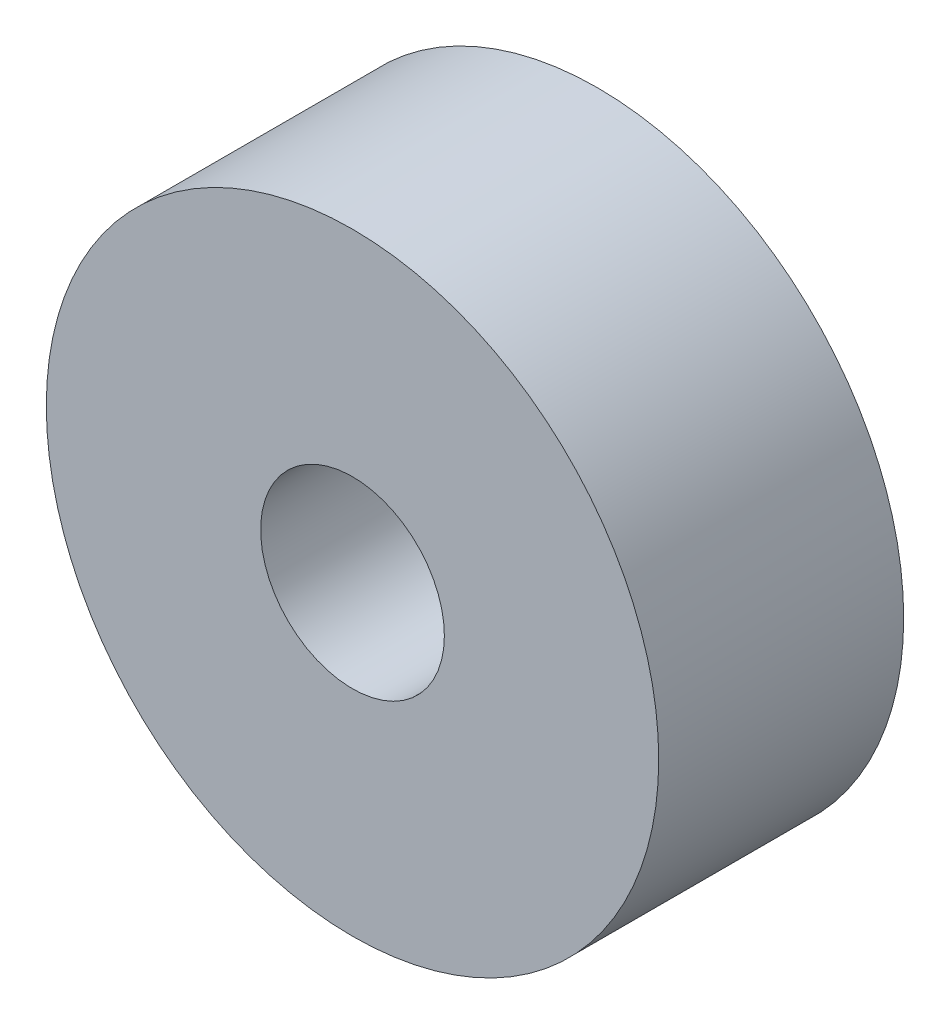
ISO-10303-21;
HEADER;
FILE_DESCRIPTION(('STEP AP214'),'2;1');
FILE_NAME('part.step','',(''),(''),'','','');
FILE_SCHEMA(('AUTOMOTIVE_DESIGN { 1 0 10303 214 1 1 1 1 }'));
ENDSEC;
DATA;
#1=APPLICATION_CONTEXT('core data for automotive mechanical design processes');
#2=APPLICATION_PROTOCOL_DEFINITION('international standard','automotive_design',2000,#1);
#3=PRODUCT_CONTEXT('',#1,'mechanical');
#4=PRODUCT('Part','Part','',(#3));
#5=PRODUCT_RELATED_PRODUCT_CATEGORY('part','',(#4));
#6=PRODUCT_DEFINITION_FORMATION('','',#4);
#7=PRODUCT_DEFINITION_CONTEXT('part definition',#1,'design');
#8=PRODUCT_DEFINITION('design','',#6,#7);
#9=PRODUCT_DEFINITION_SHAPE('','',#8);
#10=(LENGTH_UNIT() NAMED_UNIT(*) SI_UNIT(.MILLI.,.METRE.));
#11=(NAMED_UNIT(*) PLANE_ANGLE_UNIT() SI_UNIT($,.RADIAN.));
#12=(NAMED_UNIT(*) SI_UNIT($,.STERADIAN.) SOLID_ANGLE_UNIT());
#13=UNCERTAINTY_MEASURE_WITH_UNIT(LENGTH_MEASURE(1.E-05),#10,'distance_accuracy_value','');
#14=(GEOMETRIC_REPRESENTATION_CONTEXT(3) GLOBAL_UNCERTAINTY_ASSIGNED_CONTEXT((#13)) GLOBAL_UNIT_ASSIGNED_CONTEXT((#10,
#11,#12)) REPRESENTATION_CONTEXT('',''));
#15=CARTESIAN_POINT('',(0.,0.,0.));
#16=DIRECTION('',(0.,0.,1.));
#17=DIRECTION('',(1.,0.,0.));
#18=AXIS2_PLACEMENT_3D('',#15,#16,#17);
#19=CARTESIAN_POINT('',(0.,0.,4.));
#20=DIRECTION('',(0.,0.,1.));
#21=DIRECTION('',(1.,0.,0.));
#22=AXIS2_PLACEMENT_3D('',#19,#20,#21);
#23=PLANE('',#22);
#24=CARTESIAN_POINT('',(0.,0.,4.));
#25=DIRECTION('',(0.,0.,1.));
#26=DIRECTION('',(1.,0.,0.));
#27=AXIS2_PLACEMENT_3D('',#24,#25,#26);
#28=CIRCLE('',#27,5.);
#29=CARTESIAN_POINT('',(5.,0.,4.));
#30=VERTEX_POINT('',#29);
#31=EDGE_CURVE('E10',#30,#30,#28,.T.);
#32=ORIENTED_EDGE('',*,*,#31,.T.);
#33=EDGE_LOOP('',(#32));
#34=FACE_BOUND('',#33,.T.);
#35=CARTESIAN_POINT('',(0.,0.,4.));
#36=DIRECTION('',(0.,0.,1.));
#37=DIRECTION('',(1.,0.,0.));
#38=AXIS2_PLACEMENT_3D('',#35,#36,#37);
#39=CIRCLE('',#38,1.5);
#40=CARTESIAN_POINT('',(1.5,0.,4.));
#41=VERTEX_POINT('',#40);
#42=EDGE_CURVE('E41',#41,#41,#39,.T.);
#43=ORIENTED_EDGE('',*,*,#42,.F.);
#44=EDGE_LOOP('',(#43));
#45=FACE_BOUND('',#44,.T.);
#46=ADVANCED_FACE('F30',(#34,#45),#23,.T.);
#47=CARTESIAN_POINT('',(0.,0.,0.));
#48=DIRECTION('',(0.,0.,1.));
#49=DIRECTION('',(1.,0.,0.));
#50=AXIS2_PLACEMENT_3D('',#47,#48,#49);
#51=PLANE('',#50);
#52=CARTESIAN_POINT('',(0.,0.,0.));
#53=DIRECTION('',(0.,0.,1.));
#54=DIRECTION('',(1.,0.,0.));
#55=AXIS2_PLACEMENT_3D('',#52,#53,#54);
#56=CIRCLE('',#55,5.);
#57=CARTESIAN_POINT('',(5.,0.,0.));
#58=VERTEX_POINT('',#57);
#59=EDGE_CURVE('E34',#58,#58,#56,.T.);
#60=ORIENTED_EDGE('',*,*,#59,.F.);
#61=EDGE_LOOP('',(#60));
#62=FACE_BOUND('',#61,.T.);
#63=CARTESIAN_POINT('',(0.,0.,0.));
#64=DIRECTION('',(0.,0.,1.));
#65=DIRECTION('',(1.,0.,0.));
#66=AXIS2_PLACEMENT_3D('',#63,#64,#65);
#67=CIRCLE('',#66,1.5);
#68=CARTESIAN_POINT('',(1.5,0.,0.));
#69=VERTEX_POINT('',#68);
#70=EDGE_CURVE('E43',#69,#69,#67,.T.);
#71=ORIENTED_EDGE('',*,*,#70,.T.);
#72=EDGE_LOOP('',(#71));
#73=FACE_BOUND('',#72,.T.);
#74=ADVANCED_FACE('F53',(#62,#73),#51,.F.);
#75=CARTESIAN_POINT('',(0.,0.,4.));
#76=DIRECTION('',(0.,0.,-1.));
#77=DIRECTION('',(-1.,0.,0.));
#78=AXIS2_PLACEMENT_3D('',#75,#76,#77);
#79=CYLINDRICAL_SURFACE('',#78,5.);
#80=ORIENTED_EDGE('',*,*,#31,.F.);
#81=EDGE_LOOP('',(#80));
#82=FACE_BOUND('',#81,.T.);
#83=ORIENTED_EDGE('',*,*,#59,.T.);
#84=EDGE_LOOP('',(#83));
#85=FACE_BOUND('',#84,.T.);
#86=ADVANCED_FACE('F32',(#82,#85),#79,.T.);
#87=CARTESIAN_POINT('',(0.,0.,4.));
#88=DIRECTION('',(0.,0.,-1.));
#89=DIRECTION('',(-1.,0.,0.));
#90=AXIS2_PLACEMENT_3D('',#87,#88,#89);
#91=CYLINDRICAL_SURFACE('',#90,1.5);
#92=ORIENTED_EDGE('',*,*,#42,.T.);
#93=EDGE_LOOP('',(#92));
#94=FACE_BOUND('',#93,.T.);
#95=ORIENTED_EDGE('',*,*,#70,.F.);
#96=EDGE_LOOP('',(#95));
#97=FACE_BOUND('',#96,.T.);
#98=ADVANCED_FACE('F49',(#94,#97),#91,.F.);
#99=CLOSED_SHELL('',(#46,#74,#86,#98));
#100=MANIFOLD_SOLID_BREP('B2',#99);
#101=ADVANCED_BREP_SHAPE_REPRESENTATION('',(#18,#100),#14);
#102=SHAPE_DEFINITION_REPRESENTATION(#9,#101);
ENDSEC;
END-ISO-10303-21;
